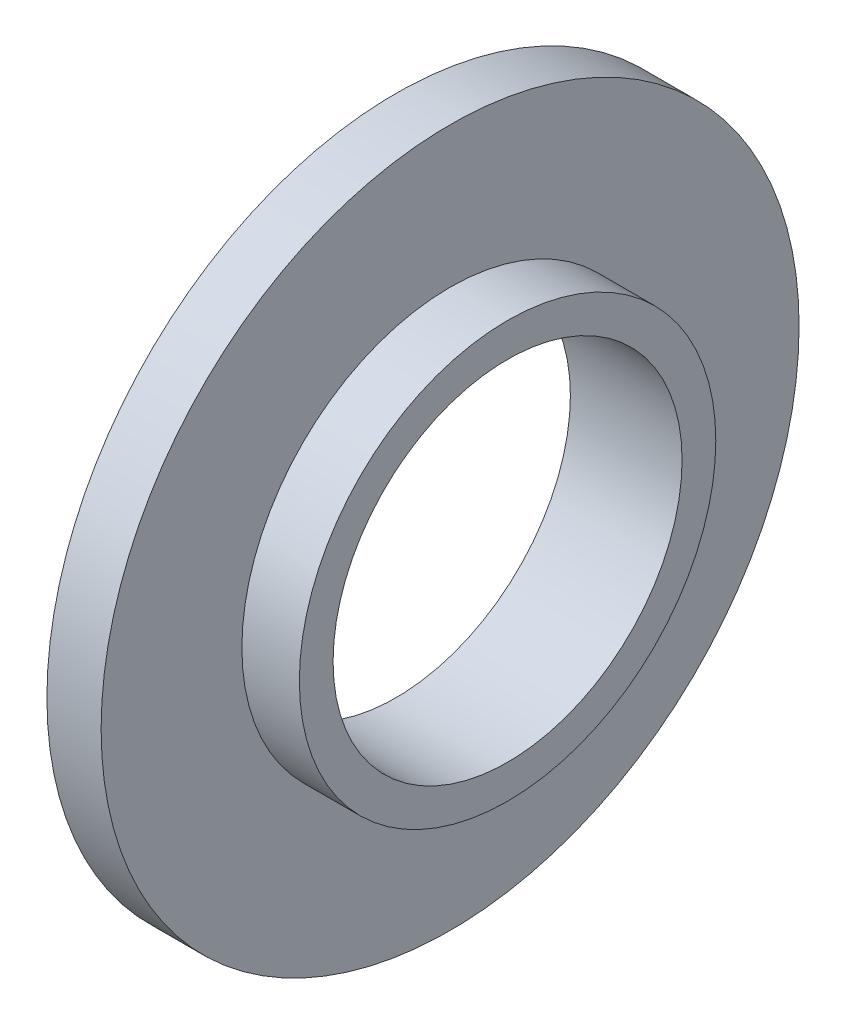
ISO-10303-21;
HEADER;
FILE_DESCRIPTION(('STEP AP214'),'2;1');
FILE_NAME('part.step','',(''),(''),'','','');
FILE_SCHEMA(('AUTOMOTIVE_DESIGN { 1 0 10303 214 1 1 1 1 }'));
ENDSEC;
DATA;
#1=APPLICATION_CONTEXT('core data for automotive mechanical design processes');
#2=APPLICATION_PROTOCOL_DEFINITION('international standard','automotive_design',2000,#1);
#3=PRODUCT_CONTEXT('',#1,'mechanical');
#4=PRODUCT('Part','Part','',(#3));
#5=PRODUCT_RELATED_PRODUCT_CATEGORY('part','',(#4));
#6=PRODUCT_DEFINITION_FORMATION('','',#4);
#7=PRODUCT_DEFINITION_CONTEXT('part definition',#1,'design');
#8=PRODUCT_DEFINITION('design','',#6,#7);
#9=PRODUCT_DEFINITION_SHAPE('','',#8);
#10=(LENGTH_UNIT() NAMED_UNIT(*) SI_UNIT(.MILLI.,.METRE.));
#11=(NAMED_UNIT(*) PLANE_ANGLE_UNIT() SI_UNIT($,.RADIAN.));
#12=(NAMED_UNIT(*) SI_UNIT($,.STERADIAN.) SOLID_ANGLE_UNIT());
#13=UNCERTAINTY_MEASURE_WITH_UNIT(LENGTH_MEASURE(1.E-05),#10,'distance_accuracy_value','');
#14=(GEOMETRIC_REPRESENTATION_CONTEXT(3) GLOBAL_UNCERTAINTY_ASSIGNED_CONTEXT((#13)) GLOBAL_UNIT_ASSIGNED_CONTEXT((#10,
#11,#12)) REPRESENTATION_CONTEXT('',''));
#15=CARTESIAN_POINT('',(0.,0.,0.));
#16=DIRECTION('',(0.,0.,1.));
#17=DIRECTION('',(1.,0.,0.));
#18=AXIS2_PLACEMENT_3D('',#15,#16,#17);
#19=CARTESIAN_POINT('',(4.66,0.,0.));
#20=DIRECTION('',(1.,0.,0.));
#21=DIRECTION('',(0.,0.,-1.));
#22=AXIS2_PLACEMENT_3D('',#19,#20,#21);
#23=PLANE('',#22);
#24=CARTESIAN_POINT('',(4.66,0.,0.));
#25=DIRECTION('',(1.,0.,0.));
#26=DIRECTION('',(0.,0.,-1.));
#27=AXIS2_PLACEMENT_3D('',#24,#25,#26);
#28=CIRCLE('',#27,30.);
#29=CARTESIAN_POINT('',(4.66,0.,-30.));
#30=VERTEX_POINT('',#29);
#31=EDGE_CURVE('E10',#30,#30,#28,.T.);
#32=ORIENTED_EDGE('',*,*,#31,.T.);
#33=EDGE_LOOP('',(#32));
#34=FACE_BOUND('',#33,.T.);
#35=CARTESIAN_POINT('',(4.66,0.,0.));
#36=DIRECTION('',(1.,0.,0.));
#37=DIRECTION('',(0.,0.,-1.));
#38=AXIS2_PLACEMENT_3D('',#35,#36,#37);
#39=CIRCLE('',#38,17.9);
#40=CARTESIAN_POINT('',(4.66,0.,-17.9));
#41=VERTEX_POINT('',#40);
#42=EDGE_CURVE('E42',#41,#41,#39,.T.);
#43=ORIENTED_EDGE('',*,*,#42,.F.);
#44=EDGE_LOOP('',(#43));
#45=FACE_BOUND('',#44,.T.);
#46=ADVANCED_FACE('F29',(#34,#45),#23,.T.);
#47=CARTESIAN_POINT('',(4.66,0.,0.));
#48=DIRECTION('',(-1.,0.,0.));
#49=DIRECTION('',(0.,0.,1.));
#50=AXIS2_PLACEMENT_3D('',#47,#48,#49);
#51=CYLINDRICAL_SURFACE('',#50,30.);
#52=ORIENTED_EDGE('',*,*,#31,.F.);
#53=EDGE_LOOP('',(#52));
#54=FACE_BOUND('',#53,.T.);
#55=CARTESIAN_POINT('',(0.,0.,0.));
#56=DIRECTION('',(1.,0.,0.));
#57=DIRECTION('',(0.,0.,-1.));
#58=AXIS2_PLACEMENT_3D('',#55,#56,#57);
#59=CIRCLE('',#58,30.);
#60=CARTESIAN_POINT('',(0.,0.,-30.));
#61=VERTEX_POINT('',#60);
#62=EDGE_CURVE('E33',#61,#61,#59,.T.);
#63=ORIENTED_EDGE('',*,*,#62,.T.);
#64=EDGE_LOOP('',(#63));
#65=FACE_BOUND('',#64,.T.);
#66=ADVANCED_FACE('F31',(#54,#65),#51,.T.);
#67=CARTESIAN_POINT('',(0.,0.,0.));
#68=DIRECTION('',(1.,0.,0.));
#69=DIRECTION('',(0.,0.,-1.));
#70=AXIS2_PLACEMENT_3D('',#67,#68,#69);
#71=PLANE('',#70);
#72=CARTESIAN_POINT('',(0.,0.,0.));
#73=DIRECTION('',(1.,0.,0.));
#74=DIRECTION('',(0.,0.,-1.));
#75=AXIS2_PLACEMENT_3D('',#72,#73,#74);
#76=CIRCLE('',#75,15.);
#77=CARTESIAN_POINT('',(0.,0.,-15.));
#78=VERTEX_POINT('',#77);
#79=EDGE_CURVE('E45',#78,#78,#76,.T.);
#80=ORIENTED_EDGE('',*,*,#79,.T.);
#81=EDGE_LOOP('',(#80));
#82=FACE_BOUND('',#81,.T.);
#83=ORIENTED_EDGE('',*,*,#62,.F.);
#84=EDGE_LOOP('',(#83));
#85=FACE_BOUND('',#84,.T.);
#86=ADVANCED_FACE('F54',(#82,#85),#71,.F.);
#87=CARTESIAN_POINT('',(9.6,0.,0.));
#88=DIRECTION('',(-1.,0.,0.));
#89=DIRECTION('',(0.,0.,1.));
#90=AXIS2_PLACEMENT_3D('',#87,#88,#89);
#91=CYLINDRICAL_SURFACE('',#90,17.9);
#92=CARTESIAN_POINT('',(9.6,0.,0.));
#93=DIRECTION('',(1.,0.,0.));
#94=DIRECTION('',(0.,0.,-1.));
#95=AXIS2_PLACEMENT_3D('',#92,#93,#94);
#96=CIRCLE('',#95,17.9);
#97=CARTESIAN_POINT('',(9.6,0.,-17.9));
#98=VERTEX_POINT('',#97);
#99=EDGE_CURVE('E40',#98,#98,#96,.T.);
#100=ORIENTED_EDGE('',*,*,#99,.F.);
#101=EDGE_LOOP('',(#100));
#102=FACE_BOUND('',#101,.T.);
#103=ORIENTED_EDGE('',*,*,#42,.T.);
#104=EDGE_LOOP('',(#103));
#105=FACE_BOUND('',#104,.T.);
#106=ADVANCED_FACE('F66',(#102,#105),#91,.T.);
#107=CARTESIAN_POINT('',(9.6,0.,0.));
#108=DIRECTION('',(1.,0.,0.));
#109=DIRECTION('',(0.,0.,-1.));
#110=AXIS2_PLACEMENT_3D('',#107,#108,#109);
#111=PLANE('',#110);
#112=CARTESIAN_POINT('',(9.6,0.,0.));
#113=DIRECTION('',(1.,0.,0.));
#114=DIRECTION('',(0.,0.,-1.));
#115=AXIS2_PLACEMENT_3D('',#112,#113,#114);
#116=CIRCLE('',#115,15.);
#117=CARTESIAN_POINT('',(9.6,0.,-15.));
#118=VERTEX_POINT('',#117);
#119=EDGE_CURVE('E48',#118,#118,#116,.T.);
#120=ORIENTED_EDGE('',*,*,#119,.F.);
#121=EDGE_LOOP('',(#120));
#122=FACE_BOUND('',#121,.T.);
#123=ORIENTED_EDGE('',*,*,#99,.T.);
#124=EDGE_LOOP('',(#123));
#125=FACE_BOUND('',#124,.T.);
#126=ADVANCED_FACE('F60',(#122,#125),#111,.T.);
#127=CARTESIAN_POINT('',(0.,0.,0.));
#128=DIRECTION('',(1.,0.,0.));
#129=DIRECTION('',(0.,0.,-1.));
#130=AXIS2_PLACEMENT_3D('',#127,#128,#129);
#131=CYLINDRICAL_SURFACE('',#130,15.);
#132=ORIENTED_EDGE('',*,*,#79,.F.);
#133=EDGE_LOOP('',(#132));
#134=FACE_BOUND('',#133,.T.);
#135=ORIENTED_EDGE('',*,*,#119,.T.);
#136=EDGE_LOOP('',(#135));
#137=FACE_BOUND('',#136,.T.);
#138=ADVANCED_FACE('F57',(#134,#137),#131,.F.);
#139=CLOSED_SHELL('',(#46,#66,#86,#106,#126,#138));
#140=MANIFOLD_SOLID_BREP('B2',#139);
#141=ADVANCED_BREP_SHAPE_REPRESENTATION('',(#18,#140),#14);
#142=SHAPE_DEFINITION_REPRESENTATION(#9,#141);
ENDSEC;
END-ISO-10303-21;
